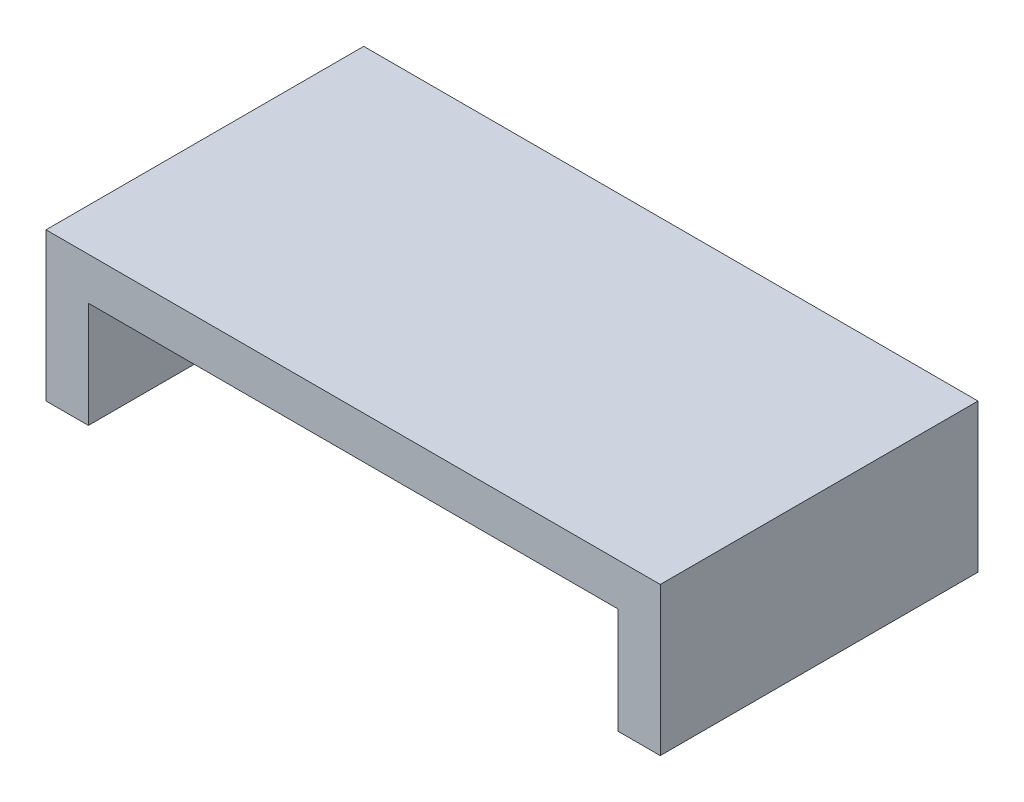
ISO-10303-21;
HEADER;
FILE_DESCRIPTION(('STEP AP214'),'2;1');
FILE_NAME('part.step','',(''),(''),'','','');
FILE_SCHEMA(('AUTOMOTIVE_DESIGN { 1 0 10303 214 1 1 1 1 }'));
ENDSEC;
DATA;
#1=APPLICATION_CONTEXT('core data for automotive mechanical design processes');
#2=APPLICATION_PROTOCOL_DEFINITION('international standard','automotive_design',2000,#1);
#3=PRODUCT_CONTEXT('',#1,'mechanical');
#4=PRODUCT('Part','Part','',(#3));
#5=PRODUCT_RELATED_PRODUCT_CATEGORY('part','',(#4));
#6=PRODUCT_DEFINITION_FORMATION('','',#4);
#7=PRODUCT_DEFINITION_CONTEXT('part definition',#1,'design');
#8=PRODUCT_DEFINITION('design','',#6,#7);
#9=PRODUCT_DEFINITION_SHAPE('','',#8);
#10=(LENGTH_UNIT() NAMED_UNIT(*) SI_UNIT(.MILLI.,.METRE.));
#11=(NAMED_UNIT(*) PLANE_ANGLE_UNIT() SI_UNIT($,.RADIAN.));
#12=(NAMED_UNIT(*) SI_UNIT($,.STERADIAN.) SOLID_ANGLE_UNIT());
#13=UNCERTAINTY_MEASURE_WITH_UNIT(LENGTH_MEASURE(1.E-05),#10,'distance_accuracy_value','');
#14=(GEOMETRIC_REPRESENTATION_CONTEXT(3) GLOBAL_UNCERTAINTY_ASSIGNED_CONTEXT((#13)) GLOBAL_UNIT_ASSIGNED_CONTEXT((#10,
#11,#12)) REPRESENTATION_CONTEXT('',''));
#15=CARTESIAN_POINT('',(0.,0.,0.));
#16=DIRECTION('',(0.,0.,1.));
#17=DIRECTION('',(1.,0.,0.));
#18=AXIS2_PLACEMENT_3D('',#15,#16,#17);
#19=CARTESIAN_POINT('',(0.,0.,150.));
#20=DIRECTION('',(0.,1.,0.));
#21=DIRECTION('',(0.,0.,1.));
#22=AXIS2_PLACEMENT_3D('',#19,#20,#21);
#23=PLANE('',#22);
#24=DIRECTION('',(1.,0.,0.));
#25=VECTOR('',#24,1.);
#26=CARTESIAN_POINT('',(0.,0.,0.));
#27=LINE('',#26,#25);
#28=CARTESIAN_POINT('',(0.,0.,0.));
#29=VERTEX_POINT('',#28);
#30=CARTESIAN_POINT('',(20.,0.,0.));
#31=VERTEX_POINT('',#30);
#32=EDGE_CURVE('E134',#29,#31,#27,.T.);
#33=ORIENTED_EDGE('',*,*,#32,.T.);
#34=DIRECTION('',(0.,0.,-1.));
#35=VECTOR('',#34,1.);
#36=CARTESIAN_POINT('',(20.,0.,150.));
#37=LINE('',#36,#35);
#38=CARTESIAN_POINT('',(20.,0.,150.));
#39=VERTEX_POINT('',#38);
#40=EDGE_CURVE('E11',#39,#31,#37,.T.);
#41=ORIENTED_EDGE('',*,*,#40,.F.);
#42=DIRECTION('',(1.,0.,0.));
#43=VECTOR('',#42,1.);
#44=CARTESIAN_POINT('',(0.,0.,150.));
#45=LINE('',#44,#43);
#46=CARTESIAN_POINT('',(0.,0.,150.));
#47=VERTEX_POINT('',#46);
#48=EDGE_CURVE('E148',#47,#39,#45,.T.);
#49=ORIENTED_EDGE('',*,*,#48,.F.);
#50=DIRECTION('',(0.,0.,-1.));
#51=VECTOR('',#50,1.);
#52=CARTESIAN_POINT('',(0.,0.,150.));
#53=LINE('',#52,#51);
#54=EDGE_CURVE('E130',#47,#29,#53,.T.);
#55=ORIENTED_EDGE('',*,*,#54,.T.);
#56=EDGE_LOOP('',(#33,#41,#49,#55));
#57=FACE_BOUND('',#56,.T.);
#58=ADVANCED_FACE('F38',(#57),#23,.F.);
#59=CARTESIAN_POINT('',(20.,0.,150.));
#60=DIRECTION('',(-1.,0.,0.));
#61=DIRECTION('',(0.,0.,1.));
#62=AXIS2_PLACEMENT_3D('',#59,#60,#61);
#63=PLANE('',#62);
#64=DIRECTION('',(0.,1.,0.));
#65=VECTOR('',#64,1.);
#66=CARTESIAN_POINT('',(20.,0.,0.));
#67=LINE('',#66,#65);
#68=CARTESIAN_POINT('',(20.,50.,0.));
#69=VERTEX_POINT('',#68);
#70=EDGE_CURVE('E137',#31,#69,#67,.T.);
#71=ORIENTED_EDGE('',*,*,#70,.T.);
#72=DIRECTION('',(0.,0.,-1.));
#73=VECTOR('',#72,1.);
#74=CARTESIAN_POINT('',(20.,50.,150.));
#75=LINE('',#74,#73);
#76=CARTESIAN_POINT('',(20.,50.,150.));
#77=VERTEX_POINT('',#76);
#78=EDGE_CURVE('E46',#77,#69,#75,.T.);
#79=ORIENTED_EDGE('',*,*,#78,.F.);
#80=DIRECTION('',(0.,1.,0.));
#81=VECTOR('',#80,1.);
#82=CARTESIAN_POINT('',(20.,0.,150.));
#83=LINE('',#82,#81);
#84=EDGE_CURVE('E97',#39,#77,#83,.T.);
#85=ORIENTED_EDGE('',*,*,#84,.F.);
#86=ORIENTED_EDGE('',*,*,#40,.T.);
#87=EDGE_LOOP('',(#71,#79,#85,#86));
#88=FACE_BOUND('',#87,.T.);
#89=ADVANCED_FACE('F183',(#88),#63,.F.);
#90=CARTESIAN_POINT('',(20.,50.,150.));
#91=DIRECTION('',(0.,1.,0.));
#92=DIRECTION('',(0.,0.,1.));
#93=AXIS2_PLACEMENT_3D('',#90,#91,#92);
#94=PLANE('',#93);
#95=DIRECTION('',(1.,0.,0.));
#96=VECTOR('',#95,1.);
#97=CARTESIAN_POINT('',(20.,50.,0.));
#98=LINE('',#97,#96);
#99=CARTESIAN_POINT('',(270.,50.,0.));
#100=VERTEX_POINT('',#99);
#101=EDGE_CURVE('E139',#69,#100,#98,.T.);
#102=ORIENTED_EDGE('',*,*,#101,.T.);
#103=DIRECTION('',(0.,0.,-1.));
#104=VECTOR('',#103,1.);
#105=CARTESIAN_POINT('',(270.,50.,150.));
#106=LINE('',#105,#104);
#107=CARTESIAN_POINT('',(270.,50.,150.));
#108=VERTEX_POINT('',#107);
#109=EDGE_CURVE('E155',#108,#100,#106,.T.);
#110=ORIENTED_EDGE('',*,*,#109,.F.);
#111=DIRECTION('',(1.,0.,0.));
#112=VECTOR('',#111,1.);
#113=CARTESIAN_POINT('',(20.,50.,150.));
#114=LINE('',#113,#112);
#115=EDGE_CURVE('E163',#77,#108,#114,.T.);
#116=ORIENTED_EDGE('',*,*,#115,.F.);
#117=ORIENTED_EDGE('',*,*,#78,.T.);
#118=EDGE_LOOP('',(#102,#110,#116,#117));
#119=FACE_BOUND('',#118,.T.);
#120=ADVANCED_FACE('F161',(#119),#94,.F.);
#121=CARTESIAN_POINT('',(270.,50.,150.));
#122=DIRECTION('',(1.,0.,0.));
#123=DIRECTION('',(0.,0.,-1.));
#124=AXIS2_PLACEMENT_3D('',#121,#122,#123);
#125=PLANE('',#124);
#126=DIRECTION('',(0.,-1.,0.));
#127=VECTOR('',#126,1.);
#128=CARTESIAN_POINT('',(270.,50.,0.));
#129=LINE('',#128,#127);
#130=CARTESIAN_POINT('',(270.,0.,0.));
#131=VERTEX_POINT('',#130);
#132=EDGE_CURVE('E141',#100,#131,#129,.T.);
#133=ORIENTED_EDGE('',*,*,#132,.T.);
#134=DIRECTION('',(0.,0.,-1.));
#135=VECTOR('',#134,1.);
#136=CARTESIAN_POINT('',(270.,0.,150.));
#137=LINE('',#136,#135);
#138=CARTESIAN_POINT('',(270.,0.,150.));
#139=VERTEX_POINT('',#138);
#140=EDGE_CURVE('E152',#139,#131,#137,.T.);
#141=ORIENTED_EDGE('',*,*,#140,.F.);
#142=DIRECTION('',(0.,-1.,0.));
#143=VECTOR('',#142,1.);
#144=CARTESIAN_POINT('',(270.,50.,150.));
#145=LINE('',#144,#143);
#146=EDGE_CURVE('E175',#108,#139,#145,.T.);
#147=ORIENTED_EDGE('',*,*,#146,.F.);
#148=ORIENTED_EDGE('',*,*,#109,.T.);
#149=EDGE_LOOP('',(#133,#141,#147,#148));
#150=FACE_BOUND('',#149,.T.);
#151=ADVANCED_FACE('F171',(#150),#125,.F.);
#152=CARTESIAN_POINT('',(270.,0.,150.));
#153=DIRECTION('',(0.,1.,0.));
#154=DIRECTION('',(0.,0.,1.));
#155=AXIS2_PLACEMENT_3D('',#152,#153,#154);
#156=PLANE('',#155);
#157=DIRECTION('',(1.,0.,0.));
#158=VECTOR('',#157,1.);
#159=CARTESIAN_POINT('',(270.,0.,0.));
#160=LINE('',#159,#158);
#161=CARTESIAN_POINT('',(290.,0.,0.));
#162=VERTEX_POINT('',#161);
#163=EDGE_CURVE('E143',#131,#162,#160,.T.);
#164=ORIENTED_EDGE('',*,*,#163,.T.);
#165=DIRECTION('',(0.,0.,-1.));
#166=VECTOR('',#165,1.);
#167=CARTESIAN_POINT('',(290.,0.,150.));
#168=LINE('',#167,#166);
#169=CARTESIAN_POINT('',(290.,0.,150.));
#170=VERTEX_POINT('',#169);
#171=EDGE_CURVE('E125',#170,#162,#168,.T.);
#172=ORIENTED_EDGE('',*,*,#171,.F.);
#173=DIRECTION('',(1.,0.,0.));
#174=VECTOR('',#173,1.);
#175=CARTESIAN_POINT('',(270.,0.,150.));
#176=LINE('',#175,#174);
#177=EDGE_CURVE('E116',#139,#170,#176,.T.);
#178=ORIENTED_EDGE('',*,*,#177,.F.);
#179=ORIENTED_EDGE('',*,*,#140,.T.);
#180=EDGE_LOOP('',(#164,#172,#178,#179));
#181=FACE_BOUND('',#180,.T.);
#182=ADVANCED_FACE('F174',(#181),#156,.F.);
#183=CARTESIAN_POINT('',(290.,70.,150.));
#184=DIRECTION('',(-1.,0.,0.));
#185=DIRECTION('',(0.,0.,1.));
#186=AXIS2_PLACEMENT_3D('',#183,#184,#185);
#187=PLANE('',#186);
#188=DIRECTION('',(0.,1.,0.));
#189=VECTOR('',#188,1.);
#190=CARTESIAN_POINT('',(290.,70.,0.));
#191=LINE('',#190,#189);
#192=CARTESIAN_POINT('',(290.,70.,0.));
#193=VERTEX_POINT('',#192);
#194=EDGE_CURVE('E124',#162,#193,#191,.T.);
#195=ORIENTED_EDGE('',*,*,#194,.T.);
#196=DIRECTION('',(0.,0.,-1.));
#197=VECTOR('',#196,1.);
#198=CARTESIAN_POINT('',(290.,70.,150.));
#199=LINE('',#198,#197);
#200=CARTESIAN_POINT('',(290.,70.,150.));
#201=VERTEX_POINT('',#200);
#202=EDGE_CURVE('E121',#201,#193,#199,.T.);
#203=ORIENTED_EDGE('',*,*,#202,.F.);
#204=DIRECTION('',(0.,1.,0.));
#205=VECTOR('',#204,1.);
#206=CARTESIAN_POINT('',(290.,70.,150.));
#207=LINE('',#206,#205);
#208=EDGE_CURVE('E110',#170,#201,#207,.T.);
#209=ORIENTED_EDGE('',*,*,#208,.F.);
#210=ORIENTED_EDGE('',*,*,#171,.T.);
#211=EDGE_LOOP('',(#195,#203,#209,#210));
#212=FACE_BOUND('',#211,.T.);
#213=ADVANCED_FACE('F122',(#212),#187,.F.);
#214=CARTESIAN_POINT('',(0.,70.,150.));
#215=DIRECTION('',(0.,-1.,0.));
#216=DIRECTION('',(0.,0.,-1.));
#217=AXIS2_PLACEMENT_3D('',#214,#215,#216);
#218=PLANE('',#217);
#219=DIRECTION('',(-1.,0.,0.));
#220=VECTOR('',#219,1.);
#221=CARTESIAN_POINT('',(0.,70.,0.));
#222=LINE('',#221,#220);
#223=CARTESIAN_POINT('',(0.,70.,0.));
#224=VERTEX_POINT('',#223);
#225=EDGE_CURVE('E83',#193,#224,#222,.T.);
#226=ORIENTED_EDGE('',*,*,#225,.T.);
#227=DIRECTION('',(0.,0.,-1.));
#228=VECTOR('',#227,1.);
#229=CARTESIAN_POINT('',(0.,70.,150.));
#230=LINE('',#229,#228);
#231=CARTESIAN_POINT('',(0.,70.,150.));
#232=VERTEX_POINT('',#231);
#233=EDGE_CURVE('E126',#232,#224,#230,.T.);
#234=ORIENTED_EDGE('',*,*,#233,.F.);
#235=DIRECTION('',(-1.,0.,0.));
#236=VECTOR('',#235,1.);
#237=CARTESIAN_POINT('',(0.,70.,150.));
#238=LINE('',#237,#236);
#239=EDGE_CURVE('E114',#201,#232,#238,.T.);
#240=ORIENTED_EDGE('',*,*,#239,.F.);
#241=ORIENTED_EDGE('',*,*,#202,.T.);
#242=EDGE_LOOP('',(#226,#234,#240,#241));
#243=FACE_BOUND('',#242,.T.);
#244=ADVANCED_FACE('F128',(#243),#218,.F.);
#245=CARTESIAN_POINT('',(0.,0.,150.));
#246=DIRECTION('',(1.,0.,0.));
#247=DIRECTION('',(0.,0.,-1.));
#248=AXIS2_PLACEMENT_3D('',#245,#246,#247);
#249=PLANE('',#248);
#250=DIRECTION('',(0.,-1.,0.));
#251=VECTOR('',#250,1.);
#252=CARTESIAN_POINT('',(0.,0.,0.));
#253=LINE('',#252,#251);
#254=EDGE_CURVE('E89',#224,#29,#253,.T.);
#255=ORIENTED_EDGE('',*,*,#254,.T.);
#256=ORIENTED_EDGE('',*,*,#54,.F.);
#257=DIRECTION('',(0.,-1.,0.));
#258=VECTOR('',#257,1.);
#259=CARTESIAN_POINT('',(0.,0.,150.));
#260=LINE('',#259,#258);
#261=EDGE_CURVE('E54',#232,#47,#260,.T.);
#262=ORIENTED_EDGE('',*,*,#261,.F.);
#263=ORIENTED_EDGE('',*,*,#233,.T.);
#264=EDGE_LOOP('',(#255,#256,#262,#263));
#265=FACE_BOUND('',#264,.T.);
#266=ADVANCED_FACE('F199',(#265),#249,.F.);
#267=CARTESIAN_POINT('',(0.,0.,150.));
#268=DIRECTION('',(0.,0.,1.));
#269=DIRECTION('',(1.,0.,0.));
#270=AXIS2_PLACEMENT_3D('',#267,#268,#269);
#271=PLANE('',#270);
#272=ORIENTED_EDGE('',*,*,#48,.T.);
#273=ORIENTED_EDGE('',*,*,#84,.T.);
#274=ORIENTED_EDGE('',*,*,#115,.T.);
#275=ORIENTED_EDGE('',*,*,#146,.T.);
#276=ORIENTED_EDGE('',*,*,#177,.T.);
#277=ORIENTED_EDGE('',*,*,#208,.T.);
#278=ORIENTED_EDGE('',*,*,#239,.T.);
#279=ORIENTED_EDGE('',*,*,#261,.T.);
#280=EDGE_LOOP('',(#272,#273,#274,#275,#276,#277,#278,#279));
#281=FACE_BOUND('',#280,.T.);
#282=ADVANCED_FACE('F112',(#281),#271,.T.);
#283=CARTESIAN_POINT('',(0.,0.,0.));
#284=DIRECTION('',(0.,0.,1.));
#285=DIRECTION('',(1.,0.,0.));
#286=AXIS2_PLACEMENT_3D('',#283,#284,#285);
#287=PLANE('',#286);
#288=ORIENTED_EDGE('',*,*,#32,.F.);
#289=ORIENTED_EDGE('',*,*,#254,.F.);
#290=ORIENTED_EDGE('',*,*,#225,.F.);
#291=ORIENTED_EDGE('',*,*,#194,.F.);
#292=ORIENTED_EDGE('',*,*,#163,.F.);
#293=ORIENTED_EDGE('',*,*,#132,.F.);
#294=ORIENTED_EDGE('',*,*,#101,.F.);
#295=ORIENTED_EDGE('',*,*,#70,.F.);
#296=EDGE_LOOP('',(#288,#289,#290,#291,#292,#293,#294,#295));
#297=FACE_BOUND('',#296,.T.);
#298=ADVANCED_FACE('F167',(#297),#287,.F.);
#299=CLOSED_SHELL('',(#58,#89,#120,#151,#182,#213,#244,#266,#282,#298));
#300=MANIFOLD_SOLID_BREP('B2',#299);
#301=ADVANCED_BREP_SHAPE_REPRESENTATION('',(#18,#300),#14);
#302=SHAPE_DEFINITION_REPRESENTATION(#9,#301);
ENDSEC;
END-ISO-10303-21;
